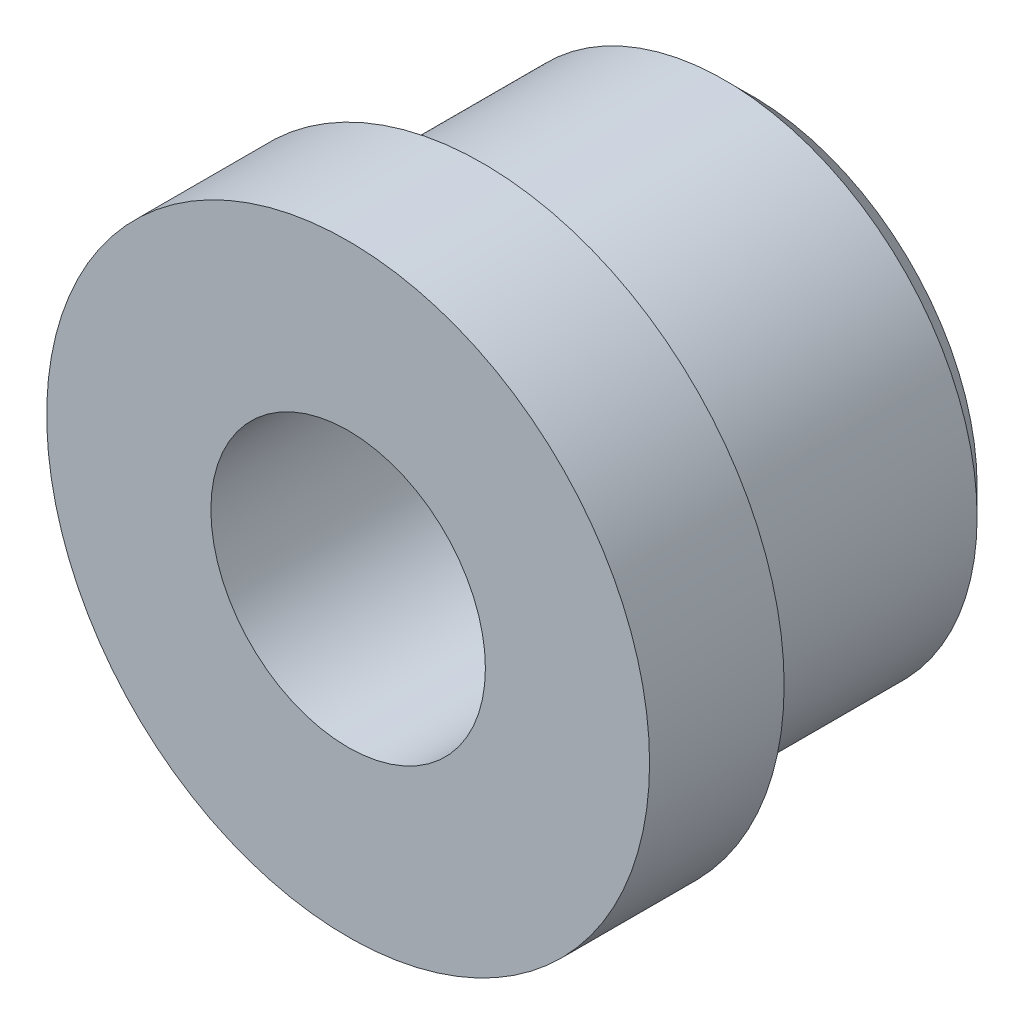
ISO-10303-21;
HEADER;
FILE_DESCRIPTION(('STEP AP214'),'2;1');
FILE_NAME('part.step','',(''),(''),'','','');
FILE_SCHEMA(('AUTOMOTIVE_DESIGN { 1 0 10303 214 1 1 1 1 }'));
ENDSEC;
DATA;
#1=APPLICATION_CONTEXT('core data for automotive mechanical design processes');
#2=APPLICATION_PROTOCOL_DEFINITION('international standard','automotive_design',2000,#1);
#3=PRODUCT_CONTEXT('',#1,'mechanical');
#4=PRODUCT('Part','Part','',(#3));
#5=PRODUCT_RELATED_PRODUCT_CATEGORY('part','',(#4));
#6=PRODUCT_DEFINITION_FORMATION('','',#4);
#7=PRODUCT_DEFINITION_CONTEXT('part definition',#1,'design');
#8=PRODUCT_DEFINITION('design','',#6,#7);
#9=PRODUCT_DEFINITION_SHAPE('','',#8);
#10=(LENGTH_UNIT() NAMED_UNIT(*) SI_UNIT(.MILLI.,.METRE.));
#11=(NAMED_UNIT(*) PLANE_ANGLE_UNIT() SI_UNIT($,.RADIAN.));
#12=(NAMED_UNIT(*) SI_UNIT($,.STERADIAN.) SOLID_ANGLE_UNIT());
#13=UNCERTAINTY_MEASURE_WITH_UNIT(LENGTH_MEASURE(1.E-05),#10,'distance_accuracy_value','');
#14=(GEOMETRIC_REPRESENTATION_CONTEXT(3) GLOBAL_UNCERTAINTY_ASSIGNED_CONTEXT((#13)) GLOBAL_UNIT_ASSIGNED_CONTEXT((#10,
#11,#12)) REPRESENTATION_CONTEXT('',''));
#15=CARTESIAN_POINT('',(0.,0.,0.));
#16=DIRECTION('',(0.,0.,1.));
#17=DIRECTION('',(1.,0.,0.));
#18=AXIS2_PLACEMENT_3D('',#15,#16,#17);
#19=CARTESIAN_POINT('',(0.,0.,-48.1449652892561));
#20=DIRECTION('',(0.,0.,1.));
#21=DIRECTION('',(1.,0.,0.));
#22=AXIS2_PLACEMENT_3D('',#19,#20,#21);
#23=CYLINDRICAL_SURFACE('',#22,11.8999);
#24=CARTESIAN_POINT('',(0.,0.,-46.8749652892561));
#25=DIRECTION('',(0.,0.,1.));
#26=DIRECTION('',(1.,0.,0.));
#27=AXIS2_PLACEMENT_3D('',#24,#25,#26);
#28=CIRCLE('',#27,11.8999);
#29=CARTESIAN_POINT('',(11.8999,0.,-46.8749652892561));
#30=VERTEX_POINT('',#29);
#31=EDGE_CURVE('E42',#30,#30,#28,.F.);
#32=ORIENTED_EDGE('',*,*,#31,.F.);
#33=EDGE_LOOP('',(#32));
#34=FACE_BOUND('',#33,.T.);
#35=CARTESIAN_POINT('',(0.,0.,-36.7149652892561));
#36=DIRECTION('',(0.,0.,-1.));
#37=DIRECTION('',(-1.,0.,0.));
#38=AXIS2_PLACEMENT_3D('',#35,#36,#37);
#39=CIRCLE('',#38,11.8999);
#40=CARTESIAN_POINT('',(-11.8999,0.,-36.7149652892561));
#41=VERTEX_POINT('',#40);
#42=EDGE_CURVE('E30',#41,#41,#39,.F.);
#43=ORIENTED_EDGE('',*,*,#42,.F.);
#44=EDGE_LOOP('',(#43));
#45=FACE_BOUND('',#44,.T.);
#46=ADVANCED_FACE('F15',(#34,#45),#23,.T.);
#47=CARTESIAN_POINT('',(0.,0.,-36.7149652892561));
#48=DIRECTION('',(0.,0.,-1.));
#49=DIRECTION('',(-1.,0.,0.));
#50=AXIS2_PLACEMENT_3D('',#47,#48,#49);
#51=CONICAL_SURFACE('',#50,11.8999,0.785398163397448);
#52=ORIENTED_EDGE('',*,*,#42,.T.);
#53=EDGE_LOOP('',(#52));
#54=FACE_BOUND('',#53,.T.);
#55=CARTESIAN_POINT('',(0.,0.,-35.4449652892561));
#56=DIRECTION('',(0.,0.,-1.));
#57=DIRECTION('',(-1.,0.,0.));
#58=AXIS2_PLACEMENT_3D('',#55,#56,#57);
#59=CIRCLE('',#58,10.6299);
#60=CARTESIAN_POINT('',(-10.6299,0.,-35.4449652892561));
#61=VERTEX_POINT('',#60);
#62=EDGE_CURVE('E18',#61,#61,#59,.F.);
#63=ORIENTED_EDGE('',*,*,#62,.F.);
#64=EDGE_LOOP('',(#63));
#65=FACE_BOUND('',#64,.T.);
#66=ADVANCED_FACE('F51',(#54,#65),#51,.T.);
#67=CARTESIAN_POINT('',(0.,0.,-46.8749652892561));
#68=DIRECTION('',(0.,0.,1.));
#69=DIRECTION('',(1.,0.,0.));
#70=AXIS2_PLACEMENT_3D('',#67,#68,#69);
#71=CONICAL_SURFACE('',#70,11.8999,0.785398163397446);
#72=CARTESIAN_POINT('',(0.,0.,-48.1449652892561));
#73=DIRECTION('',(0.,0.,1.));
#74=DIRECTION('',(1.,0.,0.));
#75=AXIS2_PLACEMENT_3D('',#72,#73,#74);
#76=CIRCLE('',#75,10.6299);
#77=CARTESIAN_POINT('',(10.6299,0.,-48.1449652892561));
#78=VERTEX_POINT('',#77);
#79=EDGE_CURVE('E37',#78,#78,#76,.F.);
#80=ORIENTED_EDGE('',*,*,#79,.F.);
#81=EDGE_LOOP('',(#80));
#82=FACE_BOUND('',#81,.T.);
#83=ORIENTED_EDGE('',*,*,#31,.T.);
#84=EDGE_LOOP('',(#83));
#85=FACE_BOUND('',#84,.T.);
#86=ADVANCED_FACE('F60',(#82,#85),#71,.T.);
#87=CARTESIAN_POINT('',(14.224,0.,-35.4449652892561));
#88=DIRECTION('',(0.,0.,-1.));
#89=DIRECTION('',(-1.,0.,0.));
#90=AXIS2_PLACEMENT_3D('',#87,#88,#89);
#91=PLANE('',#90);
#92=CARTESIAN_POINT('',(0.,0.,-35.4449652892561));
#93=DIRECTION('',(0.,0.,1.));
#94=DIRECTION('',(1.,0.,0.));
#95=AXIS2_PLACEMENT_3D('',#92,#93,#94);
#96=CIRCLE('',#95,14.224);
#97=CARTESIAN_POINT('',(14.224,0.,-35.4449652892561));
#98=VERTEX_POINT('',#97);
#99=EDGE_CURVE('E35',#98,#98,#96,.T.);
#100=ORIENTED_EDGE('',*,*,#99,.F.);
#101=EDGE_LOOP('',(#100));
#102=FACE_BOUND('',#101,.T.);
#103=ORIENTED_EDGE('',*,*,#62,.T.);
#104=EDGE_LOOP('',(#103));
#105=FACE_BOUND('',#104,.T.);
#106=ADVANCED_FACE('F79',(#102,#105),#91,.T.);
#107=CARTESIAN_POINT('',(10.6299,0.,-48.1449652892561));
#108=DIRECTION('',(0.,0.,-1.));
#109=DIRECTION('',(-1.,0.,0.));
#110=AXIS2_PLACEMENT_3D('',#107,#108,#109);
#111=PLANE('',#110);
#112=ORIENTED_EDGE('',*,*,#79,.T.);
#113=EDGE_LOOP('',(#112));
#114=FACE_BOUND('',#113,.T.);
#115=CARTESIAN_POINT('',(0.,0.,-48.1449652892561));
#116=DIRECTION('',(0.,0.,1.));
#117=DIRECTION('',(1.,0.,0.));
#118=AXIS2_PLACEMENT_3D('',#115,#116,#117);
#119=CIRCLE('',#118,6.477);
#120=CARTESIAN_POINT('',(6.477,0.,-48.1449652892561));
#121=VERTEX_POINT('',#120);
#122=EDGE_CURVE('E27',#121,#121,#119,.T.);
#123=ORIENTED_EDGE('',*,*,#122,.T.);
#124=EDGE_LOOP('',(#123));
#125=FACE_BOUND('',#124,.T.);
#126=ADVANCED_FACE('F75',(#114,#125),#111,.T.);
#127=CARTESIAN_POINT('',(0.,0.,-48.1449652892561));
#128=DIRECTION('',(0.,0.,1.));
#129=DIRECTION('',(1.,0.,0.));
#130=AXIS2_PLACEMENT_3D('',#127,#128,#129);
#131=CYLINDRICAL_SURFACE('',#130,14.224);
#132=ORIENTED_EDGE('',*,*,#99,.T.);
#133=EDGE_LOOP('',(#132));
#134=FACE_BOUND('',#133,.T.);
#135=CARTESIAN_POINT('',(0.,0.,-29.0949652892561));
#136=DIRECTION('',(0.,0.,1.));
#137=DIRECTION('',(1.,0.,0.));
#138=AXIS2_PLACEMENT_3D('',#135,#136,#137);
#139=CIRCLE('',#138,14.224);
#140=CARTESIAN_POINT('',(14.224,0.,-29.0949652892561));
#141=VERTEX_POINT('',#140);
#142=EDGE_CURVE('E22',#141,#141,#139,.T.);
#143=ORIENTED_EDGE('',*,*,#142,.F.);
#144=EDGE_LOOP('',(#143));
#145=FACE_BOUND('',#144,.T.);
#146=ADVANCED_FACE('F68',(#134,#145),#131,.T.);
#147=CARTESIAN_POINT('',(0.,0.,-48.1449652892561));
#148=DIRECTION('',(0.,0.,1.));
#149=DIRECTION('',(1.,0.,0.));
#150=AXIS2_PLACEMENT_3D('',#147,#148,#149);
#151=CYLINDRICAL_SURFACE('',#150,6.477);
#152=CARTESIAN_POINT('',(0.,0.,-29.0949652892561));
#153=DIRECTION('',(0.,0.,1.));
#154=DIRECTION('',(1.,0.,0.));
#155=AXIS2_PLACEMENT_3D('',#152,#153,#154);
#156=CIRCLE('',#155,6.477);
#157=CARTESIAN_POINT('',(6.477,0.,-29.0949652892561));
#158=VERTEX_POINT('',#157);
#159=EDGE_CURVE('E10',#158,#158,#156,.F.);
#160=ORIENTED_EDGE('',*,*,#159,.F.);
#161=EDGE_LOOP('',(#160));
#162=FACE_BOUND('',#161,.T.);
#163=ORIENTED_EDGE('',*,*,#122,.F.);
#164=EDGE_LOOP('',(#163));
#165=FACE_BOUND('',#164,.T.);
#166=ADVANCED_FACE('F63',(#162,#165),#151,.F.);
#167=CARTESIAN_POINT('',(6.477,0.,-29.0949652892561));
#168=DIRECTION('',(0.,0.,1.));
#169=DIRECTION('',(1.,0.,0.));
#170=AXIS2_PLACEMENT_3D('',#167,#168,#169);
#171=PLANE('',#170);
#172=ORIENTED_EDGE('',*,*,#159,.T.);
#173=EDGE_LOOP('',(#172));
#174=FACE_BOUND('',#173,.T.);
#175=ORIENTED_EDGE('',*,*,#142,.T.);
#176=EDGE_LOOP('',(#175));
#177=FACE_BOUND('',#176,.T.);
#178=ADVANCED_FACE('F61',(#174,#177),#171,.T.);
#179=CLOSED_SHELL('',(#46,#66,#86,#106,#126,#146,#166,#178));
#180=MANIFOLD_SOLID_BREP('B1',#179);
#181=ADVANCED_BREP_SHAPE_REPRESENTATION('',(#18,#180),#14);
#182=SHAPE_DEFINITION_REPRESENTATION(#9,#181);
ENDSEC;
END-ISO-10303-21;
